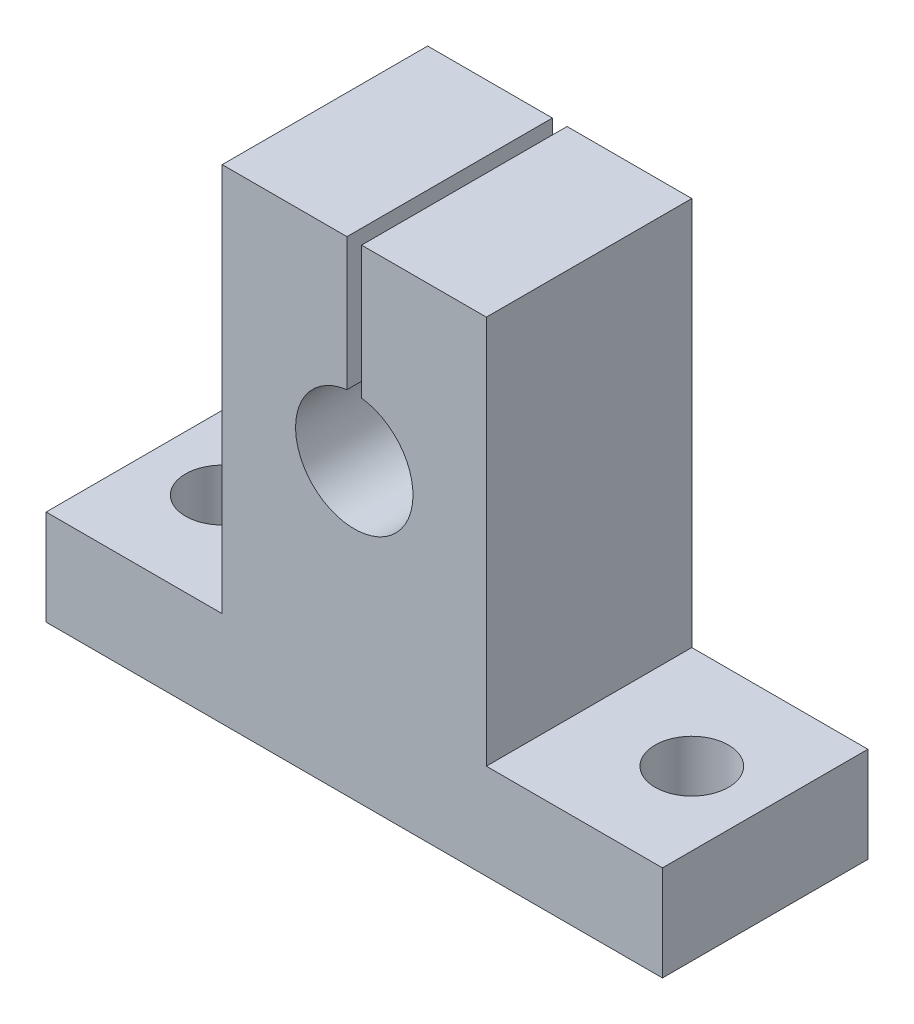
ISO-10303-21;
HEADER;
FILE_DESCRIPTION(('STEP AP214'),'2;1');
FILE_NAME('part.step','',(''),(''),'','','');
FILE_SCHEMA(('AUTOMOTIVE_DESIGN { 1 0 10303 214 1 1 1 1 }'));
ENDSEC;
DATA;
#1=APPLICATION_CONTEXT('core data for automotive mechanical design processes');
#2=APPLICATION_PROTOCOL_DEFINITION('international standard','automotive_design',2000,#1);
#3=PRODUCT_CONTEXT('',#1,'mechanical');
#4=PRODUCT('Part','Part','',(#3));
#5=PRODUCT_RELATED_PRODUCT_CATEGORY('part','',(#4));
#6=PRODUCT_DEFINITION_FORMATION('','',#4);
#7=PRODUCT_DEFINITION_CONTEXT('part definition',#1,'design');
#8=PRODUCT_DEFINITION('design','',#6,#7);
#9=PRODUCT_DEFINITION_SHAPE('','',#8);
#10=(LENGTH_UNIT() NAMED_UNIT(*) SI_UNIT(.MILLI.,.METRE.));
#11=(NAMED_UNIT(*) PLANE_ANGLE_UNIT() SI_UNIT($,.RADIAN.));
#12=(NAMED_UNIT(*) SI_UNIT($,.STERADIAN.) SOLID_ANGLE_UNIT());
#13=UNCERTAINTY_MEASURE_WITH_UNIT(LENGTH_MEASURE(1.E-05),#10,'distance_accuracy_value','');
#14=(GEOMETRIC_REPRESENTATION_CONTEXT(3) GLOBAL_UNCERTAINTY_ASSIGNED_CONTEXT((#13)) GLOBAL_UNIT_ASSIGNED_CONTEXT((#10,
#11,#12)) REPRESENTATION_CONTEXT('',''));
#15=CARTESIAN_POINT('',(0.,0.,0.));
#16=DIRECTION('',(0.,0.,1.));
#17=DIRECTION('',(1.,0.,0.));
#18=AXIS2_PLACEMENT_3D('',#15,#16,#17);
#19=CARTESIAN_POINT('',(-9.,29.75,-7.));
#20=DIRECTION('',(0.,1.,0.));
#21=DIRECTION('',(0.,0.,1.));
#22=AXIS2_PLACEMENT_3D('',#19,#20,#21);
#23=PLANE('',#22);
#24=DIRECTION('',(0.,0.,1.));
#25=VECTOR('',#24,1.);
#26=CARTESIAN_POINT('',(0.5,29.75,-7.));
#27=LINE('',#26,#25);
#28=CARTESIAN_POINT('',(0.5,29.75,-7.));
#29=VERTEX_POINT('',#28);
#30=CARTESIAN_POINT('',(0.5,29.75,7.));
#31=VERTEX_POINT('',#30);
#32=EDGE_CURVE('E158',#29,#31,#27,.T.);
#33=ORIENTED_EDGE('',*,*,#32,.T.);
#34=DIRECTION('',(-1.,0.,0.));
#35=VECTOR('',#34,1.);
#36=CARTESIAN_POINT('',(-9.,29.75,7.));
#37=LINE('',#36,#35);
#38=CARTESIAN_POINT('',(9.,29.75,7.));
#39=VERTEX_POINT('',#38);
#40=EDGE_CURVE('E261',#39,#31,#37,.T.);
#41=ORIENTED_EDGE('',*,*,#40,.F.);
#42=DIRECTION('',(0.,0.,1.));
#43=VECTOR('',#42,1.);
#44=CARTESIAN_POINT('',(9.,29.75,-7.));
#45=LINE('',#44,#43);
#46=CARTESIAN_POINT('',(9.,29.75,-7.));
#47=VERTEX_POINT('',#46);
#48=EDGE_CURVE('E184',#47,#39,#45,.T.);
#49=ORIENTED_EDGE('',*,*,#48,.F.);
#50=DIRECTION('',(-1.,0.,0.));
#51=VECTOR('',#50,1.);
#52=CARTESIAN_POINT('',(-9.,29.75,-7.));
#53=LINE('',#52,#51);
#54=EDGE_CURVE('E176',#47,#29,#53,.T.);
#55=ORIENTED_EDGE('',*,*,#54,.T.);
#56=EDGE_LOOP('',(#33,#41,#49,#55));
#57=FACE_BOUND('',#56,.T.);
#58=ADVANCED_FACE('F42',(#57),#23,.T.);
#59=CARTESIAN_POINT('',(21.,-3.25,-7.));
#60=DIRECTION('',(1.,0.,0.));
#61=DIRECTION('',(0.,0.,-1.));
#62=AXIS2_PLACEMENT_3D('',#59,#60,#61);
#63=PLANE('',#62);
#64=DIRECTION('',(0.,0.,1.));
#65=VECTOR('',#64,1.);
#66=CARTESIAN_POINT('',(21.,3.25,-7.));
#67=LINE('',#66,#65);
#68=CARTESIAN_POINT('',(21.,3.25,-7.));
#69=VERTEX_POINT('',#68);
#70=CARTESIAN_POINT('',(21.,3.25,7.));
#71=VERTEX_POINT('',#70);
#72=EDGE_CURVE('E46',#69,#71,#67,.T.);
#73=ORIENTED_EDGE('',*,*,#72,.T.);
#74=DIRECTION('',(0.,1.,0.));
#75=VECTOR('',#74,1.);
#76=CARTESIAN_POINT('',(21.,-3.25,7.));
#77=LINE('',#76,#75);
#78=CARTESIAN_POINT('',(21.,-3.25,7.));
#79=VERTEX_POINT('',#78);
#80=EDGE_CURVE('E233',#79,#71,#77,.T.);
#81=ORIENTED_EDGE('',*,*,#80,.F.);
#82=DIRECTION('',(0.,0.,1.));
#83=VECTOR('',#82,1.);
#84=CARTESIAN_POINT('',(21.,-3.25,-7.));
#85=LINE('',#84,#83);
#86=CARTESIAN_POINT('',(21.,-3.25,-7.));
#87=VERTEX_POINT('',#86);
#88=EDGE_CURVE('E11',#87,#79,#85,.T.);
#89=ORIENTED_EDGE('',*,*,#88,.F.);
#90=DIRECTION('',(0.,1.,0.));
#91=VECTOR('',#90,1.);
#92=CARTESIAN_POINT('',(21.,-3.25,-7.));
#93=LINE('',#92,#91);
#94=EDGE_CURVE('E234',#87,#69,#93,.T.);
#95=ORIENTED_EDGE('',*,*,#94,.T.);
#96=EDGE_LOOP('',(#73,#81,#89,#95));
#97=FACE_BOUND('',#96,.T.);
#98=ADVANCED_FACE('F44',(#97),#63,.T.);
#99=CARTESIAN_POINT('',(-21.,-3.25,-7.));
#100=DIRECTION('',(0.,-1.,0.));
#101=DIRECTION('',(0.,0.,-1.));
#102=AXIS2_PLACEMENT_3D('',#99,#100,#101);
#103=PLANE('',#102);
#104=CARTESIAN_POINT('',(16.,-3.25,0.));
#105=DIRECTION('',(0.,1.,0.));
#106=DIRECTION('',(0.,0.,1.));
#107=AXIS2_PLACEMENT_3D('',#104,#105,#106);
#108=CIRCLE('',#107,2.5);
#109=CARTESIAN_POINT('',(16.,-3.25,2.5));
#110=VERTEX_POINT('',#109);
#111=EDGE_CURVE('E313',#110,#110,#108,.T.);
#112=ORIENTED_EDGE('',*,*,#111,.T.);
#113=EDGE_LOOP('',(#112));
#114=FACE_BOUND('',#113,.T.);
#115=CARTESIAN_POINT('',(-16.,-3.25,0.));
#116=DIRECTION('',(0.,1.,0.));
#117=DIRECTION('',(0.,0.,-1.));
#118=AXIS2_PLACEMENT_3D('',#115,#116,#117);
#119=CIRCLE('',#118,2.5);
#120=CARTESIAN_POINT('',(-16.,-3.25,-2.49999999999999));
#121=VERTEX_POINT('',#120);
#122=EDGE_CURVE('E466',#121,#121,#119,.T.);
#123=ORIENTED_EDGE('',*,*,#122,.T.);
#124=EDGE_LOOP('',(#123));
#125=FACE_BOUND('',#124,.T.);
#126=ORIENTED_EDGE('',*,*,#88,.T.);
#127=DIRECTION('',(1.,0.,0.));
#128=VECTOR('',#127,1.);
#129=CARTESIAN_POINT('',(-21.,-3.25,7.));
#130=LINE('',#129,#128);
#131=CARTESIAN_POINT('',(-21.,-3.25,7.));
#132=VERTEX_POINT('',#131);
#133=EDGE_CURVE('E248',#132,#79,#130,.T.);
#134=ORIENTED_EDGE('',*,*,#133,.F.);
#135=DIRECTION('',(0.,0.,1.));
#136=VECTOR('',#135,1.);
#137=CARTESIAN_POINT('',(-21.,-3.25,-7.));
#138=LINE('',#137,#136);
#139=CARTESIAN_POINT('',(-21.,-3.25,-7.));
#140=VERTEX_POINT('',#139);
#141=EDGE_CURVE('E52',#140,#132,#138,.T.);
#142=ORIENTED_EDGE('',*,*,#141,.F.);
#143=DIRECTION('',(1.,0.,0.));
#144=VECTOR('',#143,1.);
#145=CARTESIAN_POINT('',(-21.,-3.25,-7.));
#146=LINE('',#145,#144);
#147=EDGE_CURVE('E206',#140,#87,#146,.T.);
#148=ORIENTED_EDGE('',*,*,#147,.T.);
#149=EDGE_LOOP('',(#126,#134,#142,#148));
#150=FACE_BOUND('',#149,.T.);
#151=ADVANCED_FACE('F284',(#114,#125,#150),#103,.T.);
#152=CARTESIAN_POINT('',(-21.,-3.25,-7.));
#153=DIRECTION('',(-1.,0.,0.));
#154=DIRECTION('',(0.,0.,1.));
#155=AXIS2_PLACEMENT_3D('',#152,#153,#154);
#156=PLANE('',#155);
#157=ORIENTED_EDGE('',*,*,#141,.T.);
#158=DIRECTION('',(0.,-1.,0.));
#159=VECTOR('',#158,1.);
#160=CARTESIAN_POINT('',(-21.,-3.25,7.));
#161=LINE('',#160,#159);
#162=CARTESIAN_POINT('',(-21.,3.25,7.));
#163=VERTEX_POINT('',#162);
#164=EDGE_CURVE('E272',#163,#132,#161,.T.);
#165=ORIENTED_EDGE('',*,*,#164,.F.);
#166=DIRECTION('',(0.,0.,1.));
#167=VECTOR('',#166,1.);
#168=CARTESIAN_POINT('',(-21.,3.25,-7.));
#169=LINE('',#168,#167);
#170=CARTESIAN_POINT('',(-21.,3.25,-7.));
#171=VERTEX_POINT('',#170);
#172=EDGE_CURVE('E212',#171,#163,#169,.T.);
#173=ORIENTED_EDGE('',*,*,#172,.F.);
#174=DIRECTION('',(0.,-1.,0.));
#175=VECTOR('',#174,1.);
#176=CARTESIAN_POINT('',(-21.,-3.25,-7.));
#177=LINE('',#176,#175);
#178=EDGE_CURVE('E202',#171,#140,#177,.T.);
#179=ORIENTED_EDGE('',*,*,#178,.T.);
#180=EDGE_LOOP('',(#157,#165,#173,#179));
#181=FACE_BOUND('',#180,.T.);
#182=ADVANCED_FACE('F287',(#181),#156,.T.);
#183=CARTESIAN_POINT('',(-21.,3.25,-7.));
#184=DIRECTION('',(0.,1.,0.));
#185=DIRECTION('',(0.,0.,1.));
#186=AXIS2_PLACEMENT_3D('',#183,#184,#185);
#187=PLANE('',#186);
#188=CARTESIAN_POINT('',(-16.,3.25,0.));
#189=DIRECTION('',(0.,1.,0.));
#190=DIRECTION('',(0.,0.,-1.));
#191=AXIS2_PLACEMENT_3D('',#188,#189,#190);
#192=CIRCLE('',#191,2.5);
#193=CARTESIAN_POINT('',(-16.,3.25,-2.49999999999999));
#194=VERTEX_POINT('',#193);
#195=EDGE_CURVE('E469',#194,#194,#192,.T.);
#196=ORIENTED_EDGE('',*,*,#195,.F.);
#197=EDGE_LOOP('',(#196));
#198=FACE_BOUND('',#197,.T.);
#199=ORIENTED_EDGE('',*,*,#172,.T.);
#200=DIRECTION('',(-1.,0.,0.));
#201=VECTOR('',#200,1.);
#202=CARTESIAN_POINT('',(-21.,3.25,7.));
#203=LINE('',#202,#201);
#204=CARTESIAN_POINT('',(-9.,3.25,7.));
#205=VERTEX_POINT('',#204);
#206=EDGE_CURVE('E268',#205,#163,#203,.T.);
#207=ORIENTED_EDGE('',*,*,#206,.F.);
#208=DIRECTION('',(0.,0.,1.));
#209=VECTOR('',#208,1.);
#210=CARTESIAN_POINT('',(-9.,3.25,-7.));
#211=LINE('',#210,#209);
#212=CARTESIAN_POINT('',(-9.,3.25,-7.));
#213=VERTEX_POINT('',#212);
#214=EDGE_CURVE('E215',#213,#205,#211,.T.);
#215=ORIENTED_EDGE('',*,*,#214,.F.);
#216=DIRECTION('',(-1.,0.,0.));
#217=VECTOR('',#216,1.);
#218=CARTESIAN_POINT('',(-21.,3.25,-7.));
#219=LINE('',#218,#217);
#220=EDGE_CURVE('E192',#213,#171,#219,.T.);
#221=ORIENTED_EDGE('',*,*,#220,.T.);
#222=EDGE_LOOP('',(#199,#207,#215,#221));
#223=FACE_BOUND('',#222,.T.);
#224=ADVANCED_FACE('F291',(#198,#223),#187,.T.);
#225=CARTESIAN_POINT('',(-9.,29.75,-7.));
#226=DIRECTION('',(-1.,0.,0.));
#227=DIRECTION('',(0.,-1.,0.));
#228=AXIS2_PLACEMENT_3D('',#225,#226,#227);
#229=PLANE('',#228);
#230=ORIENTED_EDGE('',*,*,#214,.T.);
#231=DIRECTION('',(0.,-1.,0.));
#232=VECTOR('',#231,1.);
#233=CARTESIAN_POINT('',(-9.,29.75,7.));
#234=LINE('',#233,#232);
#235=CARTESIAN_POINT('',(-9.,29.75,7.));
#236=VERTEX_POINT('',#235);
#237=EDGE_CURVE('E264',#236,#205,#234,.T.);
#238=ORIENTED_EDGE('',*,*,#237,.F.);
#239=DIRECTION('',(0.,0.,1.));
#240=VECTOR('',#239,1.);
#241=CARTESIAN_POINT('',(-9.,29.75,-7.));
#242=LINE('',#241,#240);
#243=CARTESIAN_POINT('',(-9.,29.75,-7.));
#244=VERTEX_POINT('',#243);
#245=EDGE_CURVE('E218',#244,#236,#242,.T.);
#246=ORIENTED_EDGE('',*,*,#245,.F.);
#247=DIRECTION('',(0.,-1.,0.));
#248=VECTOR('',#247,1.);
#249=CARTESIAN_POINT('',(-9.,29.75,-7.));
#250=LINE('',#249,#248);
#251=EDGE_CURVE('E186',#244,#213,#250,.T.);
#252=ORIENTED_EDGE('',*,*,#251,.T.);
#253=EDGE_LOOP('',(#230,#238,#246,#252));
#254=FACE_BOUND('',#253,.T.);
#255=ADVANCED_FACE('F295',(#254),#229,.T.);
#256=DIRECTION('',(0.,0.,1.));
#257=VECTOR('',#256,1.);
#258=CARTESIAN_POINT('',(-0.5,29.75,-7.));
#259=LINE('',#258,#257);
#260=CARTESIAN_POINT('',(-0.5,29.75,-7.));
#261=VERTEX_POINT('',#260);
#262=CARTESIAN_POINT('',(-0.5,29.75,7.));
#263=VERTEX_POINT('',#262);
#264=EDGE_CURVE('E63',#261,#263,#259,.T.);
#265=ORIENTED_EDGE('',*,*,#264,.F.);
#266=EDGE_CURVE('E187',#261,#244,#53,.T.);
#267=ORIENTED_EDGE('',*,*,#266,.T.);
#268=ORIENTED_EDGE('',*,*,#245,.T.);
#269=EDGE_CURVE('E260',#263,#236,#37,.T.);
#270=ORIENTED_EDGE('',*,*,#269,.F.);
#271=EDGE_LOOP('',(#265,#267,#268,#270));
#272=FACE_BOUND('',#271,.T.);
#273=ADVANCED_FACE('F302',(#272),#23,.T.);
#274=CARTESIAN_POINT('',(9.,29.75,-7.));
#275=DIRECTION('',(1.,0.,0.));
#276=DIRECTION('',(0.,1.,0.));
#277=AXIS2_PLACEMENT_3D('',#274,#275,#276);
#278=PLANE('',#277);
#279=ORIENTED_EDGE('',*,*,#48,.T.);
#280=DIRECTION('',(0.,1.,0.));
#281=VECTOR('',#280,1.);
#282=CARTESIAN_POINT('',(9.,29.75,7.));
#283=LINE('',#282,#281);
#284=CARTESIAN_POINT('',(9.,3.25,7.));
#285=VERTEX_POINT('',#284);
#286=EDGE_CURVE('E242',#285,#39,#283,.T.);
#287=ORIENTED_EDGE('',*,*,#286,.F.);
#288=DIRECTION('',(0.,0.,1.));
#289=VECTOR('',#288,1.);
#290=CARTESIAN_POINT('',(9.,3.25,-7.));
#291=LINE('',#290,#289);
#292=CARTESIAN_POINT('',(9.,3.25,-7.));
#293=VERTEX_POINT('',#292);
#294=EDGE_CURVE('E223',#293,#285,#291,.T.);
#295=ORIENTED_EDGE('',*,*,#294,.F.);
#296=DIRECTION('',(0.,1.,0.));
#297=VECTOR('',#296,1.);
#298=CARTESIAN_POINT('',(9.,29.75,-7.));
#299=LINE('',#298,#297);
#300=EDGE_CURVE('E195',#293,#47,#299,.T.);
#301=ORIENTED_EDGE('',*,*,#300,.T.);
#302=EDGE_LOOP('',(#279,#287,#295,#301));
#303=FACE_BOUND('',#302,.T.);
#304=ADVANCED_FACE('F280',(#303),#278,.T.);
#305=CARTESIAN_POINT('',(9.,3.25,-7.));
#306=DIRECTION('',(0.,1.,0.));
#307=DIRECTION('',(0.,0.,1.));
#308=AXIS2_PLACEMENT_3D('',#305,#306,#307);
#309=PLANE('',#308);
#310=CARTESIAN_POINT('',(16.,3.25,0.));
#311=DIRECTION('',(0.,1.,0.));
#312=DIRECTION('',(0.,0.,1.));
#313=AXIS2_PLACEMENT_3D('',#310,#311,#312);
#314=CIRCLE('',#313,2.5);
#315=CARTESIAN_POINT('',(16.,3.25,2.5));
#316=VERTEX_POINT('',#315);
#317=EDGE_CURVE('E472',#316,#316,#314,.T.);
#318=ORIENTED_EDGE('',*,*,#317,.F.);
#319=EDGE_LOOP('',(#318));
#320=FACE_BOUND('',#319,.T.);
#321=ORIENTED_EDGE('',*,*,#294,.T.);
#322=DIRECTION('',(-1.,0.,0.));
#323=VECTOR('',#322,1.);
#324=CARTESIAN_POINT('',(9.,3.25,7.));
#325=LINE('',#324,#323);
#326=EDGE_CURVE('E236',#71,#285,#325,.T.);
#327=ORIENTED_EDGE('',*,*,#326,.F.);
#328=ORIENTED_EDGE('',*,*,#72,.F.);
#329=DIRECTION('',(-1.,0.,0.));
#330=VECTOR('',#329,1.);
#331=CARTESIAN_POINT('',(9.,3.25,-7.));
#332=LINE('',#331,#330);
#333=EDGE_CURVE('E277',#69,#293,#332,.T.);
#334=ORIENTED_EDGE('',*,*,#333,.T.);
#335=EDGE_LOOP('',(#321,#327,#328,#334));
#336=FACE_BOUND('',#335,.T.);
#337=ADVANCED_FACE('F237',(#320,#336),#309,.T.);
#338=CARTESIAN_POINT('',(0.,0.,-7.));
#339=DIRECTION('',(0.,0.,-1.));
#340=DIRECTION('',(-1.,0.,0.));
#341=AXIS2_PLACEMENT_3D('',#338,#339,#340);
#342=PLANE('',#341);
#343=DIRECTION('',(0.,1.,0.));
#344=VECTOR('',#343,1.);
#345=CARTESIAN_POINT('',(0.5,20.7186269665969,-7.));
#346=LINE('',#345,#344);
#347=CARTESIAN_POINT('',(0.5,20.7186269665969,-7.));
#348=VERTEX_POINT('',#347);
#349=EDGE_CURVE('E161',#348,#29,#346,.T.);
#350=ORIENTED_EDGE('',*,*,#349,.T.);
#351=ORIENTED_EDGE('',*,*,#54,.F.);
#352=ORIENTED_EDGE('',*,*,#300,.F.);
#353=ORIENTED_EDGE('',*,*,#333,.F.);
#354=ORIENTED_EDGE('',*,*,#94,.F.);
#355=ORIENTED_EDGE('',*,*,#147,.F.);
#356=ORIENTED_EDGE('',*,*,#178,.F.);
#357=ORIENTED_EDGE('',*,*,#220,.F.);
#358=ORIENTED_EDGE('',*,*,#251,.F.);
#359=ORIENTED_EDGE('',*,*,#266,.F.);
#360=DIRECTION('',(0.,-1.,0.));
#361=VECTOR('',#360,1.);
#362=CARTESIAN_POINT('',(-0.5,20.7186269665969,-7.));
#363=LINE('',#362,#361);
#364=CARTESIAN_POINT('',(-0.5,20.7186269665969,-7.));
#365=VERTEX_POINT('',#364);
#366=EDGE_CURVE('E181',#261,#365,#363,.T.);
#367=ORIENTED_EDGE('',*,*,#366,.T.);
#368=CARTESIAN_POINT('',(0.,16.75,-7.));
#369=DIRECTION('',(0.,0.,1.));
#370=DIRECTION('',(1.,0.,0.));
#371=AXIS2_PLACEMENT_3D('',#368,#369,#370);
#372=CIRCLE('',#371,4.);
#373=EDGE_CURVE('E170',#365,#348,#372,.T.);
#374=ORIENTED_EDGE('',*,*,#373,.T.);
#375=EDGE_LOOP('',(#350,#351,#352,#353,#354,#355,#356,#357,#358,#359,#367,#374));
#376=FACE_BOUND('',#375,.T.);
#377=ADVANCED_FACE('F174',(#376),#342,.T.);
#378=CARTESIAN_POINT('',(0.,0.,7.));
#379=DIRECTION('',(0.,0.,-1.));
#380=DIRECTION('',(-1.,0.,0.));
#381=AXIS2_PLACEMENT_3D('',#378,#379,#380);
#382=PLANE('',#381);
#383=ORIENTED_EDGE('',*,*,#40,.T.);
#384=DIRECTION('',(0.,1.,0.));
#385=VECTOR('',#384,1.);
#386=CARTESIAN_POINT('',(0.5,20.7186269665969,7.));
#387=LINE('',#386,#385);
#388=CARTESIAN_POINT('',(0.5,20.7186269665969,7.));
#389=VERTEX_POINT('',#388);
#390=EDGE_CURVE('E164',#389,#31,#387,.T.);
#391=ORIENTED_EDGE('',*,*,#390,.F.);
#392=CARTESIAN_POINT('',(0.,16.75,7.));
#393=DIRECTION('',(0.,0.,1.));
#394=DIRECTION('',(1.,0.,0.));
#395=AXIS2_PLACEMENT_3D('',#392,#393,#394);
#396=CIRCLE('',#395,4.);
#397=CARTESIAN_POINT('',(-0.5,20.7186269665969,7.));
#398=VERTEX_POINT('',#397);
#399=EDGE_CURVE('E182',#398,#389,#396,.T.);
#400=ORIENTED_EDGE('',*,*,#399,.F.);
#401=DIRECTION('',(0.,-1.,0.));
#402=VECTOR('',#401,1.);
#403=CARTESIAN_POINT('',(-0.5,20.7186269665969,7.));
#404=LINE('',#403,#402);
#405=EDGE_CURVE('E299',#263,#398,#404,.T.);
#406=ORIENTED_EDGE('',*,*,#405,.F.);
#407=ORIENTED_EDGE('',*,*,#269,.T.);
#408=ORIENTED_EDGE('',*,*,#237,.T.);
#409=ORIENTED_EDGE('',*,*,#206,.T.);
#410=ORIENTED_EDGE('',*,*,#164,.T.);
#411=ORIENTED_EDGE('',*,*,#133,.T.);
#412=ORIENTED_EDGE('',*,*,#80,.T.);
#413=ORIENTED_EDGE('',*,*,#326,.T.);
#414=ORIENTED_EDGE('',*,*,#286,.T.);
#415=EDGE_LOOP('',(#383,#391,#400,#406,#407,#408,#409,#410,#411,#412,#413,#414));
#416=FACE_BOUND('',#415,.T.);
#417=ADVANCED_FACE('F245',(#416),#382,.F.);
#418=CARTESIAN_POINT('',(0.5,20.7186269665969,-7.));
#419=DIRECTION('',(1.,0.,0.));
#420=DIRECTION('',(0.,0.,-1.));
#421=AXIS2_PLACEMENT_3D('',#418,#419,#420);
#422=PLANE('',#421);
#423=ORIENTED_EDGE('',*,*,#390,.T.);
#424=ORIENTED_EDGE('',*,*,#32,.F.);
#425=ORIENTED_EDGE('',*,*,#349,.F.);
#426=DIRECTION('',(0.,0.,1.));
#427=VECTOR('',#426,1.);
#428=CARTESIAN_POINT('',(0.5,20.7186269665969,-7.));
#429=LINE('',#428,#427);
#430=EDGE_CURVE('E250',#348,#389,#429,.T.);
#431=ORIENTED_EDGE('',*,*,#430,.T.);
#432=EDGE_LOOP('',(#423,#424,#425,#431));
#433=FACE_BOUND('',#432,.T.);
#434=ADVANCED_FACE('F160',(#433),#422,.F.);
#435=CARTESIAN_POINT('',(0.,16.75,-7.));
#436=DIRECTION('',(0.,0.,1.));
#437=DIRECTION('',(1.,0.,0.));
#438=AXIS2_PLACEMENT_3D('',#435,#436,#437);
#439=CYLINDRICAL_SURFACE('',#438,4.);
#440=ORIENTED_EDGE('',*,*,#399,.T.);
#441=ORIENTED_EDGE('',*,*,#430,.F.);
#442=ORIENTED_EDGE('',*,*,#373,.F.);
#443=DIRECTION('',(0.,0.,1.));
#444=VECTOR('',#443,1.);
#445=CARTESIAN_POINT('',(-0.5,20.7186269665969,-7.));
#446=LINE('',#445,#444);
#447=EDGE_CURVE('E255',#365,#398,#446,.T.);
#448=ORIENTED_EDGE('',*,*,#447,.T.);
#449=EDGE_LOOP('',(#440,#441,#442,#448));
#450=FACE_BOUND('',#449,.T.);
#451=ADVANCED_FACE('F320',(#450),#439,.F.);
#452=CARTESIAN_POINT('',(-0.5,20.7186269665969,-7.));
#453=DIRECTION('',(-1.,0.,0.));
#454=DIRECTION('',(0.,0.,1.));
#455=AXIS2_PLACEMENT_3D('',#452,#453,#454);
#456=PLANE('',#455);
#457=ORIENTED_EDGE('',*,*,#405,.T.);
#458=ORIENTED_EDGE('',*,*,#447,.F.);
#459=ORIENTED_EDGE('',*,*,#366,.F.);
#460=ORIENTED_EDGE('',*,*,#264,.T.);
#461=EDGE_LOOP('',(#457,#458,#459,#460));
#462=FACE_BOUND('',#461,.T.);
#463=ADVANCED_FACE('F321',(#462),#456,.F.);
#464=CARTESIAN_POINT('',(16.,-3.25,0.));
#465=DIRECTION('',(0.,1.,0.));
#466=DIRECTION('',(0.,0.,1.));
#467=AXIS2_PLACEMENT_3D('',#464,#465,#466);
#468=CYLINDRICAL_SURFACE('',#467,2.5);
#469=ORIENTED_EDGE('',*,*,#111,.F.);
#470=EDGE_LOOP('',(#469));
#471=FACE_BOUND('',#470,.T.);
#472=ORIENTED_EDGE('',*,*,#317,.T.);
#473=EDGE_LOOP('',(#472));
#474=FACE_BOUND('',#473,.T.);
#475=ADVANCED_FACE('F323',(#471,#474),#468,.F.);
#476=CARTESIAN_POINT('',(-16.,-3.25,0.));
#477=DIRECTION('',(0.,1.,0.));
#478=DIRECTION('',(0.,0.,1.));
#479=AXIS2_PLACEMENT_3D('',#476,#477,#478);
#480=CYLINDRICAL_SURFACE('',#479,2.5);
#481=ORIENTED_EDGE('',*,*,#122,.F.);
#482=EDGE_LOOP('',(#481));
#483=FACE_BOUND('',#482,.T.);
#484=ORIENTED_EDGE('',*,*,#195,.T.);
#485=EDGE_LOOP('',(#484));
#486=FACE_BOUND('',#485,.T.);
#487=ADVANCED_FACE('F329',(#483,#486),#480,.F.);
#488=CLOSED_SHELL('',(#58,#98,#151,#182,#224,#255,#273,#304,#337,#377,#417,#434,#451,#463,#475,#487));
#489=MANIFOLD_SOLID_BREP('B2',#488);
#490=ADVANCED_BREP_SHAPE_REPRESENTATION('',(#18,#489),#14);
#491=SHAPE_DEFINITION_REPRESENTATION(#9,#490);
ENDSEC;
END-ISO-10303-21;
